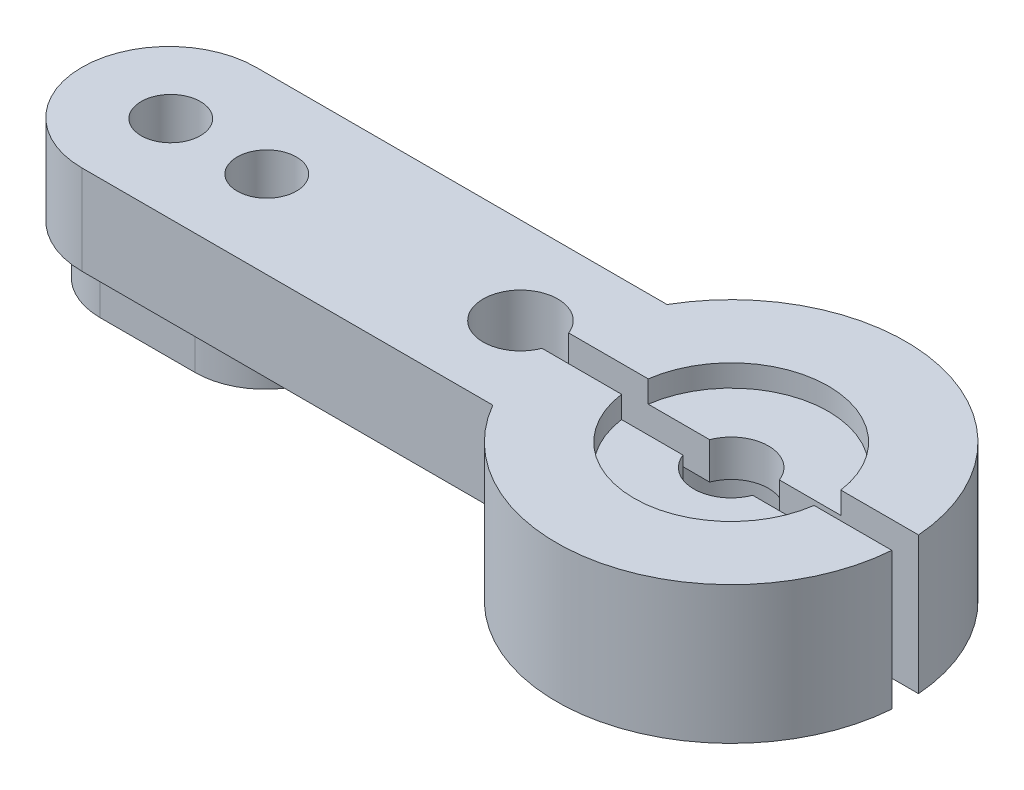
ISO-10303-21;
HEADER;
FILE_DESCRIPTION(('STEP AP214'),'2;1');
FILE_NAME('part.step','',(''),(''),'','','');
FILE_SCHEMA(('AUTOMOTIVE_DESIGN { 1 0 10303 214 1 1 1 1 }'));
ENDSEC;
DATA;
#1=APPLICATION_CONTEXT('core data for automotive mechanical design processes');
#2=APPLICATION_PROTOCOL_DEFINITION('international standard','automotive_design',2000,#1);
#3=PRODUCT_CONTEXT('',#1,'mechanical');
#4=PRODUCT('Part','Part','',(#3));
#5=PRODUCT_RELATED_PRODUCT_CATEGORY('part','',(#4));
#6=PRODUCT_DEFINITION_FORMATION('','',#4);
#7=PRODUCT_DEFINITION_CONTEXT('part definition',#1,'design');
#8=PRODUCT_DEFINITION('design','',#6,#7);
#9=PRODUCT_DEFINITION_SHAPE('','',#8);
#10=(LENGTH_UNIT() NAMED_UNIT(*) SI_UNIT(.MILLI.,.METRE.));
#11=(NAMED_UNIT(*) PLANE_ANGLE_UNIT() SI_UNIT($,.RADIAN.));
#12=(NAMED_UNIT(*) SI_UNIT($,.STERADIAN.) SOLID_ANGLE_UNIT());
#13=UNCERTAINTY_MEASURE_WITH_UNIT(LENGTH_MEASURE(1.E-05),#10,'distance_accuracy_value','');
#14=(GEOMETRIC_REPRESENTATION_CONTEXT(3) GLOBAL_UNCERTAINTY_ASSIGNED_CONTEXT((#13)) GLOBAL_UNIT_ASSIGNED_CONTEXT((#10,
#11,#12)) REPRESENTATION_CONTEXT('',''));
#15=CARTESIAN_POINT('',(0.,0.,0.));
#16=DIRECTION('',(0.,0.,1.));
#17=DIRECTION('',(1.,0.,0.));
#18=AXIS2_PLACEMENT_3D('',#15,#16,#17);
#19=CARTESIAN_POINT('',(-24.0919,2.0574,0.));
#20=DIRECTION('',(0.,1.,0.));
#21=DIRECTION('',(0.,0.,1.));
#22=AXIS2_PLACEMENT_3D('',#19,#20,#21);
#23=PLANE('',#22);
#24=CARTESIAN_POINT('',(-24.0284,2.0574,0.));
#25=DIRECTION('',(0.,-1.,0.));
#26=DIRECTION('',(0.,0.,-1.));
#27=AXIS2_PLACEMENT_3D('',#24,#25,#26);
#28=CIRCLE('',#27,3.0099);
#29=CARTESIAN_POINT('',(-24.0284,2.0574,3.0099));
#30=VERTEX_POINT('',#29);
#31=CARTESIAN_POINT('',(-24.0284,2.0574,-3.0099));
#32=VERTEX_POINT('',#31);
#33=EDGE_CURVE('E339',#30,#32,#28,.T.);
#34=ORIENTED_EDGE('',*,*,#33,.F.);
#35=DIRECTION('',(-1.,0.,0.));
#36=VECTOR('',#35,1.);
#37=CARTESIAN_POINT('',(-24.0284,2.0574,3.0099));
#38=LINE('',#37,#36);
#39=CARTESIAN_POINT('',(-19.9644,2.0574,3.0099));
#40=VERTEX_POINT('',#39);
#41=EDGE_CURVE('E332',#40,#30,#38,.T.);
#42=ORIENTED_EDGE('',*,*,#41,.F.);
#43=CARTESIAN_POINT('',(-19.9644,2.0574,0.));
#44=DIRECTION('',(0.,-1.,0.));
#45=DIRECTION('',(0.,0.,-1.));
#46=AXIS2_PLACEMENT_3D('',#43,#44,#45);
#47=CIRCLE('',#46,3.0099);
#48=CARTESIAN_POINT('',(-19.9644,2.0574,-3.0099));
#49=VERTEX_POINT('',#48);
#50=EDGE_CURVE('E343',#49,#40,#47,.T.);
#51=ORIENTED_EDGE('',*,*,#50,.F.);
#52=DIRECTION('',(1.,0.,0.));
#53=VECTOR('',#52,1.);
#54=CARTESIAN_POINT('',(-24.0284,2.0574,-3.0099));
#55=LINE('',#54,#53);
#56=EDGE_CURVE('E86',#32,#49,#55,.T.);
#57=ORIENTED_EDGE('',*,*,#56,.F.);
#58=EDGE_LOOP('',(#34,#42,#51,#57));
#59=FACE_BOUND('',#58,.T.);
#60=DIRECTION('',(1.,0.,0.));
#61=VECTOR('',#60,1.);
#62=CARTESIAN_POINT('',(-24.0919,2.0574,-0.571500000000003));
#63=LINE('',#62,#61);
#64=CARTESIAN_POINT('',(-7.5350335522599,2.0574,-0.571500000000001));
#65=VERTEX_POINT('',#64);
#66=CARTESIAN_POINT('',(-7.45843655466747,2.0574,-0.571500000000001));
#67=VERTEX_POINT('',#66);
#68=EDGE_CURVE('E293',#65,#67,#63,.T.);
#69=ORIENTED_EDGE('',*,*,#68,.F.);
#70=CARTESIAN_POINT('',(-9.0297,2.0574,0.));
#71=DIRECTION('',(0.,1.,0.));
#72=DIRECTION('',(0.,0.,1.));
#73=AXIS2_PLACEMENT_3D('',#70,#71,#72);
#74=CIRCLE('',#73,1.6002);
#75=CARTESIAN_POINT('',(-7.5350335522599,2.0574,0.5715));
#76=VERTEX_POINT('',#75);
#77=EDGE_CURVE('E244',#65,#76,#74,.T.);
#78=ORIENTED_EDGE('',*,*,#77,.T.);
#79=DIRECTION('',(1.,0.,0.));
#80=VECTOR('',#79,1.);
#81=CARTESIAN_POINT('',(-24.0919,2.0574,0.5715));
#82=LINE('',#81,#80);
#83=CARTESIAN_POINT('',(-7.45843655466747,2.0574,0.5715));
#84=VERTEX_POINT('',#83);
#85=EDGE_CURVE('E282',#76,#84,#82,.T.);
#86=ORIENTED_EDGE('',*,*,#85,.T.);
#87=CARTESIAN_POINT('',(0.,2.0574,0.));
#88=DIRECTION('',(0.,-1.,0.));
#89=DIRECTION('',(0.,0.,1.));
#90=AXIS2_PLACEMENT_3D('',#87,#88,#89);
#91=CIRCLE('',#90,7.4803);
#92=CARTESIAN_POINT('',(-6.48179185488087,2.0574,3.7338));
#93=VERTEX_POINT('',#92);
#94=EDGE_CURVE('E367',#93,#84,#91,.T.);
#95=ORIENTED_EDGE('',*,*,#94,.F.);
#96=DIRECTION('',(1.,0.,0.));
#97=VECTOR('',#96,1.);
#98=CARTESIAN_POINT('',(-24.0919,2.0574,3.7338));
#99=LINE('',#98,#97);
#100=CARTESIAN_POINT('',(-24.0919,2.0574,3.7338));
#101=VERTEX_POINT('',#100);
#102=EDGE_CURVE('E362',#101,#93,#99,.T.);
#103=ORIENTED_EDGE('',*,*,#102,.F.);
#104=CARTESIAN_POINT('',(-24.0919,2.0574,0.));
#105=DIRECTION('',(0.,1.,0.));
#106=DIRECTION('',(0.,0.,1.));
#107=AXIS2_PLACEMENT_3D('',#104,#105,#106);
#108=CIRCLE('',#107,3.7338);
#109=CARTESIAN_POINT('',(-24.0919,2.0574,-3.7338));
#110=VERTEX_POINT('',#109);
#111=EDGE_CURVE('E359',#110,#101,#108,.T.);
#112=ORIENTED_EDGE('',*,*,#111,.F.);
#113=DIRECTION('',(-1.,0.,0.));
#114=VECTOR('',#113,1.);
#115=CARTESIAN_POINT('',(-24.0919,2.0574,-3.7338));
#116=LINE('',#115,#114);
#117=CARTESIAN_POINT('',(-6.48179185488087,2.0574,-3.7338));
#118=VERTEX_POINT('',#117);
#119=EDGE_CURVE('E370',#118,#110,#116,.T.);
#120=ORIENTED_EDGE('',*,*,#119,.F.);
#121=EDGE_CURVE('E366',#67,#118,#91,.T.);
#122=ORIENTED_EDGE('',*,*,#121,.F.);
#123=EDGE_LOOP('',(#69,#78,#86,#95,#103,#112,#120,#122));
#124=FACE_BOUND('',#123,.T.);
#125=ADVANCED_FACE('F63',(#59,#124),#23,.F.);
#126=CARTESIAN_POINT('',(0.,5.8928,0.));
#127=DIRECTION('',(0.,-1.,0.));
#128=DIRECTION('',(0.,0.,-1.));
#129=AXIS2_PLACEMENT_3D('',#126,#127,#128);
#130=CYLINDRICAL_SURFACE('',#129,7.4803);
#131=DIRECTION('',(0.,-1.,0.));
#132=VECTOR('',#131,1.);
#133=CARTESIAN_POINT('',(7.45843655466747,5.8928,-0.5715));
#134=LINE('',#133,#132);
#135=CARTESIAN_POINT('',(7.45843655466747,0.,-0.5715));
#136=VERTEX_POINT('',#135);
#137=CARTESIAN_POINT('',(7.45843655466747,5.8928,-0.5715));
#138=VERTEX_POINT('',#137);
#139=EDGE_CURVE('E306',#136,#138,#134,.F.);
#140=ORIENTED_EDGE('',*,*,#139,.F.);
#141=CARTESIAN_POINT('',(0.,0.,0.));
#142=DIRECTION('',(0.,1.,0.));
#143=DIRECTION('',(0.,0.,1.));
#144=AXIS2_PLACEMENT_3D('',#141,#142,#143);
#145=CIRCLE('',#144,7.4803);
#146=CARTESIAN_POINT('',(-7.45843655466747,0.,-0.571500000000001));
#147=VERTEX_POINT('',#146);
#148=EDGE_CURVE('E405',#136,#147,#145,.T.);
#149=ORIENTED_EDGE('',*,*,#148,.T.);
#150=DIRECTION('',(0.,-1.,0.));
#151=VECTOR('',#150,1.);
#152=CARTESIAN_POINT('',(-7.45843655466747,5.8928,-0.571500000000001));
#153=LINE('',#152,#151);
#154=EDGE_CURVE('E291',#67,#147,#153,.T.);
#155=ORIENTED_EDGE('',*,*,#154,.F.);
#156=ORIENTED_EDGE('',*,*,#121,.T.);
#157=DIRECTION('',(0.,1.,0.));
#158=VECTOR('',#157,1.);
#159=CARTESIAN_POINT('',(-6.48179185488087,2.0574,-3.7338));
#160=LINE('',#159,#158);
#161=CARTESIAN_POINT('',(-6.48179185488087,5.8928,-3.7338));
#162=VERTEX_POINT('',#161);
#163=EDGE_CURVE('E383',#118,#162,#160,.T.);
#164=ORIENTED_EDGE('',*,*,#163,.T.);
#165=CARTESIAN_POINT('',(0.,5.8928,0.));
#166=DIRECTION('',(0.,1.,0.));
#167=DIRECTION('',(0.,0.,1.));
#168=AXIS2_PLACEMENT_3D('',#165,#166,#167);
#169=CIRCLE('',#168,7.4803);
#170=EDGE_CURVE('E401',#138,#162,#169,.T.);
#171=ORIENTED_EDGE('',*,*,#170,.F.);
#172=EDGE_LOOP('',(#140,#149,#155,#156,#164,#171));
#173=FACE_BOUND('',#172,.T.);
#174=ADVANCED_FACE('F65',(#173),#130,.T.);
#175=CARTESIAN_POINT('',(-7.45843655466747,0.,0.5715));
#176=VERTEX_POINT('',#175);
#177=CARTESIAN_POINT('',(7.45843655466747,0.,0.5715));
#178=VERTEX_POINT('',#177);
#179=EDGE_CURVE('E402',#176,#178,#145,.T.);
#180=ORIENTED_EDGE('',*,*,#179,.T.);
#181=DIRECTION('',(0.,-1.,0.));
#182=VECTOR('',#181,1.);
#183=CARTESIAN_POINT('',(7.45843655466747,5.8928,0.5715));
#184=LINE('',#183,#182);
#185=CARTESIAN_POINT('',(7.45843655466747,5.8928,0.5715));
#186=VERTEX_POINT('',#185);
#187=EDGE_CURVE('E316',#178,#186,#184,.F.);
#188=ORIENTED_EDGE('',*,*,#187,.T.);
#189=CARTESIAN_POINT('',(-6.48179185488087,5.8928,3.7338));
#190=VERTEX_POINT('',#189);
#191=EDGE_CURVE('E397',#190,#186,#169,.T.);
#192=ORIENTED_EDGE('',*,*,#191,.F.);
#193=DIRECTION('',(0.,1.,0.));
#194=VECTOR('',#193,1.);
#195=CARTESIAN_POINT('',(-6.48179185488087,2.0574,3.7338));
#196=LINE('',#195,#194);
#197=EDGE_CURVE('E386',#93,#190,#196,.T.);
#198=ORIENTED_EDGE('',*,*,#197,.F.);
#199=ORIENTED_EDGE('',*,*,#94,.T.);
#200=DIRECTION('',(0.,-1.,0.));
#201=VECTOR('',#200,1.);
#202=CARTESIAN_POINT('',(-7.45843655466747,5.8928,0.5715));
#203=LINE('',#202,#201);
#204=EDGE_CURVE('E279',#84,#176,#203,.T.);
#205=ORIENTED_EDGE('',*,*,#204,.T.);
#206=EDGE_LOOP('',(#180,#188,#192,#198,#199,#205));
#207=FACE_BOUND('',#206,.T.);
#208=ADVANCED_FACE('F482',(#207),#130,.T.);
#209=CARTESIAN_POINT('',(0.,5.8928,0.));
#210=DIRECTION('',(0.,1.,0.));
#211=DIRECTION('',(0.,0.,1.));
#212=AXIS2_PLACEMENT_3D('',#209,#210,#211);
#213=PLANE('',#212);
#214=CARTESIAN_POINT('',(-24.0157,5.8928,0.));
#215=DIRECTION('',(0.,1.,0.));
#216=DIRECTION('',(0.,0.,1.));
#217=AXIS2_PLACEMENT_3D('',#214,#215,#216);
#218=CIRCLE('',#217,1.27);
#219=CARTESIAN_POINT('',(-24.0157,5.8928,1.27));
#220=VERTEX_POINT('',#219);
#221=EDGE_CURVE('E464',#220,#220,#218,.T.);
#222=ORIENTED_EDGE('',*,*,#221,.F.);
#223=EDGE_LOOP('',(#222));
#224=FACE_BOUND('',#223,.T.);
#225=CARTESIAN_POINT('',(-19.9009,5.8928,0.));
#226=DIRECTION('',(0.,1.,0.));
#227=DIRECTION('',(0.,0.,1.));
#228=AXIS2_PLACEMENT_3D('',#225,#226,#227);
#229=CIRCLE('',#228,1.27);
#230=CARTESIAN_POINT('',(-19.9009,5.8928,1.27));
#231=VERTEX_POINT('',#230);
#232=EDGE_CURVE('E461',#231,#231,#229,.T.);
#233=ORIENTED_EDGE('',*,*,#232,.F.);
#234=EDGE_LOOP('',(#233));
#235=FACE_BOUND('',#234,.T.);
#236=DIRECTION('',(1.,0.,0.));
#237=VECTOR('',#236,1.);
#238=CARTESIAN_POINT('',(-9.0297,5.8928,0.5715));
#239=LINE('',#238,#237);
#240=CARTESIAN_POINT('',(4.12621026003281,5.8928,0.5715));
#241=VERTEX_POINT('',#240);
#242=EDGE_CURVE('E453',#241,#186,#239,.T.);
#243=ORIENTED_EDGE('',*,*,#242,.F.);
#244=CARTESIAN_POINT('',(0.,5.8928,0.));
#245=DIRECTION('',(0.,1.,0.));
#246=DIRECTION('',(0.,0.,1.));
#247=AXIS2_PLACEMENT_3D('',#244,#245,#246);
#248=CIRCLE('',#247,4.1656);
#249=CARTESIAN_POINT('',(-4.12621026003281,5.8928,0.5715));
#250=VERTEX_POINT('',#249);
#251=EDGE_CURVE('E320',#250,#241,#248,.T.);
#252=ORIENTED_EDGE('',*,*,#251,.F.);
#253=CARTESIAN_POINT('',(-7.5350335522599,5.8928,0.5715));
#254=VERTEX_POINT('',#253);
#255=EDGE_CURVE('E263',#254,#250,#239,.T.);
#256=ORIENTED_EDGE('',*,*,#255,.F.);
#257=CARTESIAN_POINT('',(-9.0297,5.8928,0.));
#258=DIRECTION('',(0.,1.,0.));
#259=DIRECTION('',(0.,0.,1.));
#260=AXIS2_PLACEMENT_3D('',#257,#258,#259);
#261=CIRCLE('',#260,1.6002);
#262=CARTESIAN_POINT('',(-7.5350335522599,5.8928,-0.571500000000001));
#263=VERTEX_POINT('',#262);
#264=EDGE_CURVE('E241',#263,#254,#261,.T.);
#265=ORIENTED_EDGE('',*,*,#264,.F.);
#266=DIRECTION('',(1.,0.,0.));
#267=VECTOR('',#266,1.);
#268=CARTESIAN_POINT('',(-9.0297,5.8928,-0.571500000000001));
#269=LINE('',#268,#267);
#270=CARTESIAN_POINT('',(-4.12621026003281,5.8928,-0.571500000000001));
#271=VERTEX_POINT('',#270);
#272=EDGE_CURVE('E250',#263,#271,#269,.T.);
#273=ORIENTED_EDGE('',*,*,#272,.T.);
#274=CARTESIAN_POINT('',(4.12621026003281,5.8928,-0.5715));
#275=VERTEX_POINT('',#274);
#276=EDGE_CURVE('E325',#275,#271,#248,.T.);
#277=ORIENTED_EDGE('',*,*,#276,.F.);
#278=EDGE_CURVE('E257',#275,#138,#269,.T.);
#279=ORIENTED_EDGE('',*,*,#278,.T.);
#280=ORIENTED_EDGE('',*,*,#170,.T.);
#281=DIRECTION('',(-1.,0.,0.));
#282=VECTOR('',#281,1.);
#283=CARTESIAN_POINT('',(-24.0919,5.8928,-3.7338));
#284=LINE('',#283,#282);
#285=CARTESIAN_POINT('',(-24.0919,5.8928,-3.7338));
#286=VERTEX_POINT('',#285);
#287=EDGE_CURVE('E363',#162,#286,#284,.T.);
#288=ORIENTED_EDGE('',*,*,#287,.T.);
#289=CARTESIAN_POINT('',(-24.0919,5.8928,0.));
#290=DIRECTION('',(0.,1.,0.));
#291=DIRECTION('',(0.,0.,1.));
#292=AXIS2_PLACEMENT_3D('',#289,#290,#291);
#293=CIRCLE('',#292,3.7338);
#294=CARTESIAN_POINT('',(-24.0919,5.8928,3.7338));
#295=VERTEX_POINT('',#294);
#296=EDGE_CURVE('E358',#286,#295,#293,.T.);
#297=ORIENTED_EDGE('',*,*,#296,.T.);
#298=DIRECTION('',(1.,0.,0.));
#299=VECTOR('',#298,1.);
#300=CARTESIAN_POINT('',(-24.0919,5.8928,3.7338));
#301=LINE('',#300,#299);
#302=EDGE_CURVE('E376',#295,#190,#301,.T.);
#303=ORIENTED_EDGE('',*,*,#302,.T.);
#304=ORIENTED_EDGE('',*,*,#191,.T.);
#305=EDGE_LOOP('',(#243,#252,#256,#265,#273,#277,#279,#280,#288,#297,#303,#304));
#306=FACE_BOUND('',#305,.T.);
#307=ADVANCED_FACE('F261',(#224,#235,#306),#213,.T.);
#308=CARTESIAN_POINT('',(0.,0.,0.));
#309=DIRECTION('',(0.,1.,0.));
#310=DIRECTION('',(0.,0.,1.));
#311=AXIS2_PLACEMENT_3D('',#308,#309,#310);
#312=PLANE('',#311);
#313=DIRECTION('',(1.,0.,0.));
#314=VECTOR('',#313,1.);
#315=CARTESIAN_POINT('',(-9.0297,0.,-0.571500000000001));
#316=LINE('',#315,#314);
#317=CARTESIAN_POINT('',(2.72195103556254,0.,-0.5715));
#318=VERTEX_POINT('',#317);
#319=EDGE_CURVE('E445',#318,#136,#316,.T.);
#320=ORIENTED_EDGE('',*,*,#319,.F.);
#321=CARTESIAN_POINT('',(0.,0.,0.));
#322=DIRECTION('',(0.,-1.,0.));
#323=DIRECTION('',(0.,0.,-1.));
#324=AXIS2_PLACEMENT_3D('',#321,#322,#323);
#325=CIRCLE('',#324,2.7813);
#326=CARTESIAN_POINT('',(-2.72195103556254,0.,-0.571500000000001));
#327=VERTEX_POINT('',#326);
#328=EDGE_CURVE('E382',#327,#318,#325,.T.);
#329=ORIENTED_EDGE('',*,*,#328,.F.);
#330=EDGE_CURVE('E446',#147,#327,#316,.T.);
#331=ORIENTED_EDGE('',*,*,#330,.F.);
#332=ORIENTED_EDGE('',*,*,#148,.F.);
#333=EDGE_LOOP('',(#320,#329,#331,#332));
#334=FACE_BOUND('',#333,.T.);
#335=ADVANCED_FACE('F443',(#334),#312,.F.);
#336=CARTESIAN_POINT('',(2.72195103556254,0.,0.5715));
#337=VERTEX_POINT('',#336);
#338=CARTESIAN_POINT('',(-2.72195103556254,0.,0.5715));
#339=VERTEX_POINT('',#338);
#340=EDGE_CURVE('E394',#337,#339,#325,.T.);
#341=ORIENTED_EDGE('',*,*,#340,.F.);
#342=DIRECTION('',(1.,0.,0.));
#343=VECTOR('',#342,1.);
#344=CARTESIAN_POINT('',(-9.0297,0.,0.5715));
#345=LINE('',#344,#343);
#346=EDGE_CURVE('E258',#337,#178,#345,.T.);
#347=ORIENTED_EDGE('',*,*,#346,.T.);
#348=ORIENTED_EDGE('',*,*,#179,.F.);
#349=EDGE_CURVE('E449',#176,#339,#345,.T.);
#350=ORIENTED_EDGE('',*,*,#349,.T.);
#351=EDGE_LOOP('',(#341,#347,#348,#350));
#352=FACE_BOUND('',#351,.T.);
#353=ADVANCED_FACE('F525',(#352),#312,.F.);
#354=CARTESIAN_POINT('',(0.,3.3782,0.));
#355=DIRECTION('',(0.,-1.,0.));
#356=DIRECTION('',(0.,0.,-1.));
#357=AXIS2_PLACEMENT_3D('',#354,#355,#356);
#358=CYLINDRICAL_SURFACE('',#357,2.7813);
#359=DIRECTION('',(0.,-1.,0.));
#360=VECTOR('',#359,1.);
#361=CARTESIAN_POINT('',(2.72195103556254,3.3782,-0.5715));
#362=LINE('',#361,#360);
#363=CARTESIAN_POINT('',(2.72195103556254,3.3782,-0.5715));
#364=VERTEX_POINT('',#363);
#365=EDGE_CURVE('E304',#364,#318,#362,.T.);
#366=ORIENTED_EDGE('',*,*,#365,.F.);
#367=CARTESIAN_POINT('',(0.,3.3782,0.));
#368=DIRECTION('',(0.,-1.,0.));
#369=DIRECTION('',(0.,0.,-1.));
#370=AXIS2_PLACEMENT_3D('',#367,#368,#369);
#371=CIRCLE('',#370,2.7813);
#372=CARTESIAN_POINT('',(-2.72195103556254,3.3782,-0.571500000000001));
#373=VERTEX_POINT('',#372);
#374=EDGE_CURVE('E390',#373,#364,#371,.T.);
#375=ORIENTED_EDGE('',*,*,#374,.F.);
#376=DIRECTION('',(0.,-1.,0.));
#377=VECTOR('',#376,1.);
#378=CARTESIAN_POINT('',(-2.72195103556254,3.3782,-0.571500000000001));
#379=LINE('',#378,#377);
#380=EDGE_CURVE('E289',#327,#373,#379,.F.);
#381=ORIENTED_EDGE('',*,*,#380,.F.);
#382=ORIENTED_EDGE('',*,*,#328,.T.);
#383=EDGE_LOOP('',(#366,#375,#381,#382));
#384=FACE_BOUND('',#383,.T.);
#385=ADVANCED_FACE('F522',(#384),#358,.F.);
#386=CARTESIAN_POINT('',(2.72195103556254,3.3782,0.5715));
#387=VERTEX_POINT('',#386);
#388=CARTESIAN_POINT('',(-2.72195103556254,3.3782,0.5715));
#389=VERTEX_POINT('',#388);
#390=EDGE_CURVE('E393',#387,#389,#371,.T.);
#391=ORIENTED_EDGE('',*,*,#390,.F.);
#392=DIRECTION('',(0.,-1.,0.));
#393=VECTOR('',#392,1.);
#394=CARTESIAN_POINT('',(2.72195103556254,3.3782,0.5715));
#395=LINE('',#394,#393);
#396=EDGE_CURVE('E313',#387,#337,#395,.T.);
#397=ORIENTED_EDGE('',*,*,#396,.T.);
#398=ORIENTED_EDGE('',*,*,#340,.T.);
#399=DIRECTION('',(0.,-1.,0.));
#400=VECTOR('',#399,1.);
#401=CARTESIAN_POINT('',(-2.72195103556254,3.3782,0.5715));
#402=LINE('',#401,#400);
#403=EDGE_CURVE('E276',#339,#389,#402,.F.);
#404=ORIENTED_EDGE('',*,*,#403,.T.);
#405=EDGE_LOOP('',(#391,#397,#398,#404));
#406=FACE_BOUND('',#405,.T.);
#407=ADVANCED_FACE('F524',(#406),#358,.F.);
#408=CARTESIAN_POINT('',(0.,3.3782,0.));
#409=DIRECTION('',(0.,-1.,0.));
#410=DIRECTION('',(0.,0.,-1.));
#411=AXIS2_PLACEMENT_3D('',#408,#409,#410);
#412=PLANE('',#411);
#413=ORIENTED_EDGE('',*,*,#374,.T.);
#414=DIRECTION('',(-1.,0.,0.));
#415=VECTOR('',#414,1.);
#416=CARTESIAN_POINT('',(0.,3.3782,-0.571500000000001));
#417=LINE('',#416,#415);
#418=CARTESIAN_POINT('',(1.4946664477401,3.3782,-0.571500000000001));
#419=VERTEX_POINT('',#418);
#420=EDGE_CURVE('E301',#364,#419,#417,.T.);
#421=ORIENTED_EDGE('',*,*,#420,.T.);
#422=CARTESIAN_POINT('',(0.,3.3782,0.));
#423=DIRECTION('',(0.,-1.,0.));
#424=DIRECTION('',(0.,0.,-1.));
#425=AXIS2_PLACEMENT_3D('',#422,#423,#424);
#426=CIRCLE('',#425,1.6002);
#427=CARTESIAN_POINT('',(-1.4946664477401,3.3782,-0.571500000000001));
#428=VERTEX_POINT('',#427);
#429=EDGE_CURVE('E295',#428,#419,#426,.T.);
#430=ORIENTED_EDGE('',*,*,#429,.F.);
#431=DIRECTION('',(-1.,0.,0.));
#432=VECTOR('',#431,1.);
#433=CARTESIAN_POINT('',(0.,3.3782,-0.571500000000001));
#434=LINE('',#433,#432);
#435=EDGE_CURVE('E286',#428,#373,#434,.T.);
#436=ORIENTED_EDGE('',*,*,#435,.T.);
#437=EDGE_LOOP('',(#413,#421,#430,#436));
#438=FACE_BOUND('',#437,.T.);
#439=ADVANCED_FACE('F521',(#438),#412,.T.);
#440=CARTESIAN_POINT('',(0.,4.953,0.));
#441=DIRECTION('',(0.,1.,0.));
#442=DIRECTION('',(0.,0.,1.));
#443=AXIS2_PLACEMENT_3D('',#440,#441,#442);
#444=CYLINDRICAL_SURFACE('',#443,4.1656);
#445=DIRECTION('',(0.,1.,0.));
#446=VECTOR('',#445,1.);
#447=CARTESIAN_POINT('',(4.12621026003281,4.953,-0.5715));
#448=LINE('',#447,#446);
#449=CARTESIAN_POINT('',(4.12621026003281,4.953,-0.5715));
#450=VERTEX_POINT('',#449);
#451=EDGE_CURVE('E299',#275,#450,#448,.F.);
#452=ORIENTED_EDGE('',*,*,#451,.F.);
#453=ORIENTED_EDGE('',*,*,#276,.T.);
#454=DIRECTION('',(0.,1.,0.));
#455=VECTOR('',#454,1.);
#456=CARTESIAN_POINT('',(-4.12621026003281,4.953,-0.571500000000001));
#457=LINE('',#456,#455);
#458=CARTESIAN_POINT('',(-4.12621026003281,4.953,-0.571500000000001));
#459=VERTEX_POINT('',#458);
#460=EDGE_CURVE('E253',#459,#271,#457,.T.);
#461=ORIENTED_EDGE('',*,*,#460,.F.);
#462=CARTESIAN_POINT('',(0.,4.953,0.));
#463=DIRECTION('',(0.,1.,0.));
#464=DIRECTION('',(0.,0.,1.));
#465=AXIS2_PLACEMENT_3D('',#462,#463,#464);
#466=CIRCLE('',#465,4.1656);
#467=EDGE_CURVE('E324',#450,#459,#466,.T.);
#468=ORIENTED_EDGE('',*,*,#467,.F.);
#469=EDGE_LOOP('',(#452,#453,#461,#468));
#470=FACE_BOUND('',#469,.T.);
#471=ADVANCED_FACE('F428',(#470),#444,.F.);
#472=ORIENTED_EDGE('',*,*,#251,.T.);
#473=DIRECTION('',(0.,1.,0.));
#474=VECTOR('',#473,1.);
#475=CARTESIAN_POINT('',(4.12621026003281,4.953,0.5715));
#476=LINE('',#475,#474);
#477=CARTESIAN_POINT('',(4.12621026003281,4.953,0.5715));
#478=VERTEX_POINT('',#477);
#479=EDGE_CURVE('E308',#241,#478,#476,.F.);
#480=ORIENTED_EDGE('',*,*,#479,.T.);
#481=CARTESIAN_POINT('',(-4.12621026003281,4.953,0.5715));
#482=VERTEX_POINT('',#481);
#483=EDGE_CURVE('E321',#482,#478,#466,.T.);
#484=ORIENTED_EDGE('',*,*,#483,.F.);
#485=DIRECTION('',(0.,1.,0.));
#486=VECTOR('',#485,1.);
#487=CARTESIAN_POINT('',(-4.12621026003281,4.953,0.5715));
#488=LINE('',#487,#486);
#489=EDGE_CURVE('E78',#482,#250,#488,.T.);
#490=ORIENTED_EDGE('',*,*,#489,.T.);
#491=EDGE_LOOP('',(#472,#480,#484,#490));
#492=FACE_BOUND('',#491,.T.);
#493=ADVANCED_FACE('F557',(#492),#444,.F.);
#494=CARTESIAN_POINT('',(0.,4.953,0.));
#495=DIRECTION('',(0.,1.,0.));
#496=DIRECTION('',(0.,0.,1.));
#497=AXIS2_PLACEMENT_3D('',#494,#495,#496);
#498=PLANE('',#497);
#499=CARTESIAN_POINT('',(0.,4.953,0.));
#500=DIRECTION('',(0.,1.,0.));
#501=DIRECTION('',(0.,0.,1.));
#502=AXIS2_PLACEMENT_3D('',#499,#500,#501);
#503=CIRCLE('',#502,1.6002);
#504=CARTESIAN_POINT('',(1.4946664477401,4.953,-0.571500000000001));
#505=VERTEX_POINT('',#504);
#506=CARTESIAN_POINT('',(-1.4946664477401,4.953,-0.571500000000001));
#507=VERTEX_POINT('',#506);
#508=EDGE_CURVE('E71',#505,#507,#503,.T.);
#509=ORIENTED_EDGE('',*,*,#508,.F.);
#510=DIRECTION('',(1.,0.,0.));
#511=VECTOR('',#510,1.);
#512=CARTESIAN_POINT('',(0.,4.953,-0.571500000000001));
#513=LINE('',#512,#511);
#514=EDGE_CURVE('E12',#505,#450,#513,.T.);
#515=ORIENTED_EDGE('',*,*,#514,.T.);
#516=ORIENTED_EDGE('',*,*,#467,.T.);
#517=DIRECTION('',(1.,0.,0.));
#518=VECTOR('',#517,1.);
#519=CARTESIAN_POINT('',(0.,4.953,-0.571500000000001));
#520=LINE('',#519,#518);
#521=EDGE_CURVE('E411',#459,#507,#520,.T.);
#522=ORIENTED_EDGE('',*,*,#521,.T.);
#523=EDGE_LOOP('',(#509,#515,#516,#522));
#524=FACE_BOUND('',#523,.T.);
#525=ADVANCED_FACE('F424',(#524),#498,.T.);
#526=DIRECTION('',(-1.,0.,0.));
#527=VECTOR('',#526,1.);
#528=CARTESIAN_POINT('',(0.,3.3782,0.5715));
#529=LINE('',#528,#527);
#530=CARTESIAN_POINT('',(1.4946664477401,3.3782,0.5715));
#531=VERTEX_POINT('',#530);
#532=EDGE_CURVE('E311',#387,#531,#529,.T.);
#533=ORIENTED_EDGE('',*,*,#532,.F.);
#534=ORIENTED_EDGE('',*,*,#390,.T.);
#535=DIRECTION('',(-1.,0.,0.));
#536=VECTOR('',#535,1.);
#537=CARTESIAN_POINT('',(0.,3.3782,0.5715));
#538=LINE('',#537,#536);
#539=CARTESIAN_POINT('',(-1.4946664477401,3.3782,0.5715));
#540=VERTEX_POINT('',#539);
#541=EDGE_CURVE('E273',#540,#389,#538,.T.);
#542=ORIENTED_EDGE('',*,*,#541,.F.);
#543=CARTESIAN_POINT('',(0.,3.3782,0.));
#544=DIRECTION('',(0.,-1.,0.));
#545=DIRECTION('',(0.,0.,-1.));
#546=AXIS2_PLACEMENT_3D('',#543,#544,#545);
#547=CIRCLE('',#546,1.6002);
#548=EDGE_CURVE('E297',#531,#540,#547,.T.);
#549=ORIENTED_EDGE('',*,*,#548,.F.);
#550=EDGE_LOOP('',(#533,#534,#542,#549));
#551=FACE_BOUND('',#550,.T.);
#552=ADVANCED_FACE('F516',(#551),#412,.T.);
#553=CARTESIAN_POINT('',(-24.0919,2.0574,0.));
#554=DIRECTION('',(0.,1.,0.));
#555=DIRECTION('',(0.,0.,1.));
#556=AXIS2_PLACEMENT_3D('',#553,#554,#555);
#557=CYLINDRICAL_SURFACE('',#556,3.7338);
#558=ORIENTED_EDGE('',*,*,#296,.F.);
#559=DIRECTION('',(0.,1.,0.));
#560=VECTOR('',#559,1.);
#561=CARTESIAN_POINT('',(-24.0919,2.0574,-3.7338));
#562=LINE('',#561,#560);
#563=EDGE_CURVE('E380',#110,#286,#562,.T.);
#564=ORIENTED_EDGE('',*,*,#563,.F.);
#565=ORIENTED_EDGE('',*,*,#111,.T.);
#566=DIRECTION('',(0.,1.,0.));
#567=VECTOR('',#566,1.);
#568=CARTESIAN_POINT('',(-24.0919,2.0574,3.7338));
#569=LINE('',#568,#567);
#570=EDGE_CURVE('E373',#101,#295,#569,.T.);
#571=ORIENTED_EDGE('',*,*,#570,.T.);
#572=EDGE_LOOP('',(#558,#564,#565,#571));
#573=FACE_BOUND('',#572,.T.);
#574=ADVANCED_FACE('F509',(#573),#557,.T.);
#575=CARTESIAN_POINT('',(-24.0919,2.0574,-3.7338));
#576=DIRECTION('',(0.,0.,-1.));
#577=DIRECTION('',(-1.,0.,0.));
#578=AXIS2_PLACEMENT_3D('',#575,#576,#577);
#579=PLANE('',#578);
#580=ORIENTED_EDGE('',*,*,#287,.F.);
#581=ORIENTED_EDGE('',*,*,#163,.F.);
#582=ORIENTED_EDGE('',*,*,#119,.T.);
#583=ORIENTED_EDGE('',*,*,#563,.T.);
#584=EDGE_LOOP('',(#580,#581,#582,#583));
#585=FACE_BOUND('',#584,.T.);
#586=ADVANCED_FACE('F505',(#585),#579,.T.);
#587=CARTESIAN_POINT('',(-24.0919,2.0574,3.7338));
#588=DIRECTION('',(0.,0.,1.));
#589=DIRECTION('',(1.,0.,0.));
#590=AXIS2_PLACEMENT_3D('',#587,#588,#589);
#591=PLANE('',#590);
#592=ORIENTED_EDGE('',*,*,#302,.F.);
#593=ORIENTED_EDGE('',*,*,#570,.F.);
#594=ORIENTED_EDGE('',*,*,#102,.T.);
#595=ORIENTED_EDGE('',*,*,#197,.T.);
#596=EDGE_LOOP('',(#592,#593,#594,#595));
#597=FACE_BOUND('',#596,.T.);
#598=ADVANCED_FACE('F508',(#597),#591,.T.);
#599=CARTESIAN_POINT('',(-24.0284,0.,0.));
#600=DIRECTION('',(0.,1.,0.));
#601=DIRECTION('',(0.,0.,1.));
#602=AXIS2_PLACEMENT_3D('',#599,#600,#601);
#603=CYLINDRICAL_SURFACE('',#602,3.0099);
#604=ORIENTED_EDGE('',*,*,#33,.T.);
#605=DIRECTION('',(0.,1.,0.));
#606=VECTOR('',#605,1.);
#607=CARTESIAN_POINT('',(-24.0284,0.,-3.0099));
#608=LINE('',#607,#606);
#609=CARTESIAN_POINT('',(-24.0284,0.,-3.0099));
#610=VERTEX_POINT('',#609);
#611=EDGE_CURVE('E356',#610,#32,#608,.T.);
#612=ORIENTED_EDGE('',*,*,#611,.F.);
#613=CARTESIAN_POINT('',(-24.0284,0.,0.));
#614=DIRECTION('',(0.,-1.,0.));
#615=DIRECTION('',(0.,0.,-1.));
#616=AXIS2_PLACEMENT_3D('',#613,#614,#615);
#617=CIRCLE('',#616,3.0099);
#618=CARTESIAN_POINT('',(-24.0284,0.,3.0099));
#619=VERTEX_POINT('',#618);
#620=EDGE_CURVE('E328',#619,#610,#617,.T.);
#621=ORIENTED_EDGE('',*,*,#620,.F.);
#622=DIRECTION('',(0.,1.,0.));
#623=VECTOR('',#622,1.);
#624=CARTESIAN_POINT('',(-24.0284,0.,3.0099));
#625=LINE('',#624,#623);
#626=EDGE_CURVE('E338',#619,#30,#625,.T.);
#627=ORIENTED_EDGE('',*,*,#626,.T.);
#628=EDGE_LOOP('',(#604,#612,#621,#627));
#629=FACE_BOUND('',#628,.T.);
#630=ADVANCED_FACE('F503',(#629),#603,.T.);
#631=CARTESIAN_POINT('',(-24.0284,0.,-3.0099));
#632=DIRECTION('',(0.,0.,1.));
#633=DIRECTION('',(1.,0.,0.));
#634=AXIS2_PLACEMENT_3D('',#631,#632,#633);
#635=PLANE('',#634);
#636=ORIENTED_EDGE('',*,*,#56,.T.);
#637=DIRECTION('',(0.,1.,0.));
#638=VECTOR('',#637,1.);
#639=CARTESIAN_POINT('',(-19.9644,0.,-3.0099));
#640=LINE('',#639,#638);
#641=CARTESIAN_POINT('',(-19.9644,0.,-3.0099));
#642=VERTEX_POINT('',#641);
#643=EDGE_CURVE('E353',#642,#49,#640,.T.);
#644=ORIENTED_EDGE('',*,*,#643,.F.);
#645=DIRECTION('',(1.,0.,0.));
#646=VECTOR('',#645,1.);
#647=CARTESIAN_POINT('',(-24.0284,0.,-3.0099));
#648=LINE('',#647,#646);
#649=EDGE_CURVE('E331',#610,#642,#648,.T.);
#650=ORIENTED_EDGE('',*,*,#649,.F.);
#651=ORIENTED_EDGE('',*,*,#611,.T.);
#652=EDGE_LOOP('',(#636,#644,#650,#651));
#653=FACE_BOUND('',#652,.T.);
#654=ADVANCED_FACE('F725',(#653),#635,.F.);
#655=CARTESIAN_POINT('',(-19.9644,0.,0.));
#656=DIRECTION('',(0.,1.,0.));
#657=DIRECTION('',(0.,0.,1.));
#658=AXIS2_PLACEMENT_3D('',#655,#656,#657);
#659=CYLINDRICAL_SURFACE('',#658,3.0099);
#660=ORIENTED_EDGE('',*,*,#50,.T.);
#661=DIRECTION('',(0.,1.,0.));
#662=VECTOR('',#661,1.);
#663=CARTESIAN_POINT('',(-19.9644,0.,3.0099));
#664=LINE('',#663,#662);
#665=CARTESIAN_POINT('',(-19.9644,0.,3.0099));
#666=VERTEX_POINT('',#665);
#667=EDGE_CURVE('E350',#666,#40,#664,.T.);
#668=ORIENTED_EDGE('',*,*,#667,.F.);
#669=CARTESIAN_POINT('',(-19.9644,0.,0.));
#670=DIRECTION('',(0.,-1.,0.));
#671=DIRECTION('',(0.,0.,-1.));
#672=AXIS2_PLACEMENT_3D('',#669,#670,#671);
#673=CIRCLE('',#672,3.0099);
#674=EDGE_CURVE('E334',#642,#666,#673,.T.);
#675=ORIENTED_EDGE('',*,*,#674,.F.);
#676=ORIENTED_EDGE('',*,*,#643,.T.);
#677=EDGE_LOOP('',(#660,#668,#675,#676));
#678=FACE_BOUND('',#677,.T.);
#679=ADVANCED_FACE('F722',(#678),#659,.T.);
#680=CARTESIAN_POINT('',(-24.0284,0.,3.0099));
#681=DIRECTION('',(0.,0.,-1.));
#682=DIRECTION('',(-1.,0.,0.));
#683=AXIS2_PLACEMENT_3D('',#680,#681,#682);
#684=PLANE('',#683);
#685=ORIENTED_EDGE('',*,*,#41,.T.);
#686=ORIENTED_EDGE('',*,*,#626,.F.);
#687=DIRECTION('',(-1.,0.,0.));
#688=VECTOR('',#687,1.);
#689=CARTESIAN_POINT('',(-24.0284,0.,3.0099));
#690=LINE('',#689,#688);
#691=EDGE_CURVE('E336',#666,#619,#690,.T.);
#692=ORIENTED_EDGE('',*,*,#691,.F.);
#693=ORIENTED_EDGE('',*,*,#667,.T.);
#694=EDGE_LOOP('',(#685,#686,#692,#693));
#695=FACE_BOUND('',#694,.T.);
#696=ADVANCED_FACE('F645',(#695),#684,.F.);
#697=CARTESIAN_POINT('',(-24.0284,0.,0.));
#698=DIRECTION('',(0.,-1.,0.));
#699=DIRECTION('',(0.,0.,-1.));
#700=AXIS2_PLACEMENT_3D('',#697,#698,#699);
#701=PLANE('',#700);
#702=CARTESIAN_POINT('',(-24.0157,0.,0.));
#703=DIRECTION('',(0.,1.,0.));
#704=DIRECTION('',(0.,0.,1.));
#705=AXIS2_PLACEMENT_3D('',#702,#703,#704);
#706=CIRCLE('',#705,1.27);
#707=CARTESIAN_POINT('',(-24.0157,0.,1.27));
#708=VERTEX_POINT('',#707);
#709=EDGE_CURVE('E274',#708,#708,#706,.T.);
#710=ORIENTED_EDGE('',*,*,#709,.T.);
#711=EDGE_LOOP('',(#710));
#712=FACE_BOUND('',#711,.T.);
#713=CARTESIAN_POINT('',(-19.9009,0.,0.));
#714=DIRECTION('',(0.,1.,0.));
#715=DIRECTION('',(0.,0.,1.));
#716=AXIS2_PLACEMENT_3D('',#713,#714,#715);
#717=CIRCLE('',#716,1.27);
#718=CARTESIAN_POINT('',(-19.9009,0.,1.27));
#719=VERTEX_POINT('',#718);
#720=EDGE_CURVE('E458',#719,#719,#717,.T.);
#721=ORIENTED_EDGE('',*,*,#720,.T.);
#722=EDGE_LOOP('',(#721));
#723=FACE_BOUND('',#722,.T.);
#724=ORIENTED_EDGE('',*,*,#620,.T.);
#725=ORIENTED_EDGE('',*,*,#649,.T.);
#726=ORIENTED_EDGE('',*,*,#674,.T.);
#727=ORIENTED_EDGE('',*,*,#691,.T.);
#728=EDGE_LOOP('',(#724,#725,#726,#727));
#729=FACE_BOUND('',#728,.T.);
#730=ADVANCED_FACE('F470',(#712,#723,#729),#701,.T.);
#731=DIRECTION('',(1.,0.,0.));
#732=VECTOR('',#731,1.);
#733=CARTESIAN_POINT('',(0.,4.953,0.5715));
#734=LINE('',#733,#732);
#735=CARTESIAN_POINT('',(1.4946664477401,4.953,0.5715));
#736=VERTEX_POINT('',#735);
#737=EDGE_CURVE('E409',#736,#478,#734,.T.);
#738=ORIENTED_EDGE('',*,*,#737,.F.);
#739=CARTESIAN_POINT('',(0.,4.953,0.));
#740=DIRECTION('',(0.,1.,0.));
#741=DIRECTION('',(0.,0.,1.));
#742=AXIS2_PLACEMENT_3D('',#739,#740,#741);
#743=CIRCLE('',#742,1.6002);
#744=CARTESIAN_POINT('',(-1.4946664477401,4.953,0.5715));
#745=VERTEX_POINT('',#744);
#746=EDGE_CURVE('E407',#745,#736,#743,.T.);
#747=ORIENTED_EDGE('',*,*,#746,.F.);
#748=DIRECTION('',(1.,0.,0.));
#749=VECTOR('',#748,1.);
#750=CARTESIAN_POINT('',(0.,4.953,0.5715));
#751=LINE('',#750,#749);
#752=EDGE_CURVE('E400',#482,#745,#751,.T.);
#753=ORIENTED_EDGE('',*,*,#752,.F.);
#754=ORIENTED_EDGE('',*,*,#483,.T.);
#755=EDGE_LOOP('',(#738,#747,#753,#754));
#756=FACE_BOUND('',#755,.T.);
#757=ADVANCED_FACE('F555',(#756),#498,.T.);
#758=CARTESIAN_POINT('',(-9.0297,0.,0.));
#759=DIRECTION('',(0.,1.,0.));
#760=DIRECTION('',(0.,0.,1.));
#761=AXIS2_PLACEMENT_3D('',#758,#759,#760);
#762=CYLINDRICAL_SURFACE('',#761,1.6002);
#763=DIRECTION('',(0.,1.,0.));
#764=VECTOR('',#763,1.);
#765=CARTESIAN_POINT('',(-7.5350335522599,0.,-0.571500000000001));
#766=LINE('',#765,#764);
#767=EDGE_CURVE('E236',#263,#65,#766,.F.);
#768=ORIENTED_EDGE('',*,*,#767,.F.);
#769=ORIENTED_EDGE('',*,*,#264,.T.);
#770=DIRECTION('',(0.,1.,0.));
#771=VECTOR('',#770,1.);
#772=CARTESIAN_POINT('',(-7.5350335522599,0.,0.5715));
#773=LINE('',#772,#771);
#774=EDGE_CURVE('E247',#254,#76,#773,.F.);
#775=ORIENTED_EDGE('',*,*,#774,.T.);
#776=ORIENTED_EDGE('',*,*,#77,.F.);
#777=EDGE_LOOP('',(#768,#769,#775,#776));
#778=FACE_BOUND('',#777,.T.);
#779=ADVANCED_FACE('F238',(#778),#762,.F.);
#780=CARTESIAN_POINT('',(-9.0297,0.,0.5715));
#781=DIRECTION('',(0.,0.,1.));
#782=DIRECTION('',(1.,0.,0.));
#783=AXIS2_PLACEMENT_3D('',#780,#781,#782);
#784=PLANE('',#783);
#785=ORIENTED_EDGE('',*,*,#346,.F.);
#786=ORIENTED_EDGE('',*,*,#396,.F.);
#787=ORIENTED_EDGE('',*,*,#532,.T.);
#788=DIRECTION('',(0.,1.,0.));
#789=VECTOR('',#788,1.);
#790=CARTESIAN_POINT('',(1.4946664477401,0.,0.5715));
#791=LINE('',#790,#789);
#792=EDGE_CURVE('E421',#531,#736,#791,.T.);
#793=ORIENTED_EDGE('',*,*,#792,.T.);
#794=ORIENTED_EDGE('',*,*,#737,.T.);
#795=ORIENTED_EDGE('',*,*,#479,.F.);
#796=ORIENTED_EDGE('',*,*,#242,.T.);
#797=ORIENTED_EDGE('',*,*,#187,.F.);
#798=EDGE_LOOP('',(#785,#786,#787,#793,#794,#795,#796,#797));
#799=FACE_BOUND('',#798,.T.);
#800=ADVANCED_FACE('F544',(#799),#784,.F.);
#801=CARTESIAN_POINT('',(-9.0297,0.,-0.571500000000001));
#802=DIRECTION('',(0.,0.,1.));
#803=DIRECTION('',(1.,0.,0.));
#804=AXIS2_PLACEMENT_3D('',#801,#802,#803);
#805=PLANE('',#804);
#806=ORIENTED_EDGE('',*,*,#139,.T.);
#807=ORIENTED_EDGE('',*,*,#278,.F.);
#808=ORIENTED_EDGE('',*,*,#451,.T.);
#809=ORIENTED_EDGE('',*,*,#514,.F.);
#810=DIRECTION('',(0.,1.,0.));
#811=VECTOR('',#810,1.);
#812=CARTESIAN_POINT('',(1.4946664477401,0.,-0.571500000000001));
#813=LINE('',#812,#811);
#814=EDGE_CURVE('E264',#419,#505,#813,.T.);
#815=ORIENTED_EDGE('',*,*,#814,.F.);
#816=ORIENTED_EDGE('',*,*,#420,.F.);
#817=ORIENTED_EDGE('',*,*,#365,.T.);
#818=ORIENTED_EDGE('',*,*,#319,.T.);
#819=EDGE_LOOP('',(#806,#807,#808,#809,#815,#816,#817,#818));
#820=FACE_BOUND('',#819,.T.);
#821=ADVANCED_FACE('F671',(#820),#805,.T.);
#822=ORIENTED_EDGE('',*,*,#68,.T.);
#823=ORIENTED_EDGE('',*,*,#154,.T.);
#824=ORIENTED_EDGE('',*,*,#330,.T.);
#825=ORIENTED_EDGE('',*,*,#380,.T.);
#826=ORIENTED_EDGE('',*,*,#435,.F.);
#827=DIRECTION('',(0.,1.,0.));
#828=VECTOR('',#827,1.);
#829=CARTESIAN_POINT('',(-1.4946664477401,0.,-0.571500000000001));
#830=LINE('',#829,#828);
#831=EDGE_CURVE('E267',#507,#428,#830,.F.);
#832=ORIENTED_EDGE('',*,*,#831,.F.);
#833=ORIENTED_EDGE('',*,*,#521,.F.);
#834=ORIENTED_EDGE('',*,*,#460,.T.);
#835=ORIENTED_EDGE('',*,*,#272,.F.);
#836=ORIENTED_EDGE('',*,*,#767,.T.);
#837=EDGE_LOOP('',(#822,#823,#824,#825,#826,#832,#833,#834,#835,#836));
#838=FACE_BOUND('',#837,.T.);
#839=ADVANCED_FACE('F251',(#838),#805,.T.);
#840=ORIENTED_EDGE('',*,*,#774,.F.);
#841=ORIENTED_EDGE('',*,*,#255,.T.);
#842=ORIENTED_EDGE('',*,*,#489,.F.);
#843=ORIENTED_EDGE('',*,*,#752,.T.);
#844=DIRECTION('',(0.,1.,0.));
#845=VECTOR('',#844,1.);
#846=CARTESIAN_POINT('',(-1.4946664477401,0.,0.5715));
#847=LINE('',#846,#845);
#848=EDGE_CURVE('E448',#745,#540,#847,.F.);
#849=ORIENTED_EDGE('',*,*,#848,.T.);
#850=ORIENTED_EDGE('',*,*,#541,.T.);
#851=ORIENTED_EDGE('',*,*,#403,.F.);
#852=ORIENTED_EDGE('',*,*,#349,.F.);
#853=ORIENTED_EDGE('',*,*,#204,.F.);
#854=ORIENTED_EDGE('',*,*,#85,.F.);
#855=EDGE_LOOP('',(#840,#841,#842,#843,#849,#850,#851,#852,#853,#854));
#856=FACE_BOUND('',#855,.T.);
#857=ADVANCED_FACE('F551',(#856),#784,.F.);
#858=CARTESIAN_POINT('',(0.,0.,0.));
#859=DIRECTION('',(0.,1.,0.));
#860=DIRECTION('',(0.,0.,1.));
#861=AXIS2_PLACEMENT_3D('',#858,#859,#860);
#862=CYLINDRICAL_SURFACE('',#861,1.6002);
#863=ORIENTED_EDGE('',*,*,#548,.T.);
#864=ORIENTED_EDGE('',*,*,#848,.F.);
#865=ORIENTED_EDGE('',*,*,#746,.T.);
#866=ORIENTED_EDGE('',*,*,#792,.F.);
#867=EDGE_LOOP('',(#863,#864,#865,#866));
#868=FACE_BOUND('',#867,.T.);
#869=ADVANCED_FACE('F492',(#868),#862,.F.);
#870=ORIENTED_EDGE('',*,*,#429,.T.);
#871=ORIENTED_EDGE('',*,*,#814,.T.);
#872=ORIENTED_EDGE('',*,*,#508,.T.);
#873=ORIENTED_EDGE('',*,*,#831,.T.);
#874=EDGE_LOOP('',(#870,#871,#872,#873));
#875=FACE_BOUND('',#874,.T.);
#876=ADVANCED_FACE('F417',(#875),#862,.F.);
#877=CARTESIAN_POINT('',(-19.9009,0.,0.));
#878=DIRECTION('',(0.,1.,0.));
#879=DIRECTION('',(0.,0.,1.));
#880=AXIS2_PLACEMENT_3D('',#877,#878,#879);
#881=CYLINDRICAL_SURFACE('',#880,1.27);
#882=ORIENTED_EDGE('',*,*,#720,.F.);
#883=EDGE_LOOP('',(#882));
#884=FACE_BOUND('',#883,.T.);
#885=ORIENTED_EDGE('',*,*,#232,.T.);
#886=EDGE_LOOP('',(#885));
#887=FACE_BOUND('',#886,.T.);
#888=ADVANCED_FACE('F476',(#884,#887),#881,.F.);
#889=CARTESIAN_POINT('',(-24.0157,0.,0.));
#890=DIRECTION('',(0.,1.,0.));
#891=DIRECTION('',(0.,0.,1.));
#892=AXIS2_PLACEMENT_3D('',#889,#890,#891);
#893=CYLINDRICAL_SURFACE('',#892,1.27);
#894=ORIENTED_EDGE('',*,*,#709,.F.);
#895=EDGE_LOOP('',(#894));
#896=FACE_BOUND('',#895,.T.);
#897=ORIENTED_EDGE('',*,*,#221,.T.);
#898=EDGE_LOOP('',(#897));
#899=FACE_BOUND('',#898,.T.);
#900=ADVANCED_FACE('F473',(#896,#899),#893,.F.);
#901=CLOSED_SHELL('',(#125,#174,#208,#307,#335,#353,#385,#407,#439,#471,#493,#525,#552,#574,
#586,#598,#630,#654,#679,#696,#730,#757,#779,#800,#821,#839,#857,#869,#876,#888,#900));
#902=MANIFOLD_SOLID_BREP('B2',#901);
#903=ADVANCED_BREP_SHAPE_REPRESENTATION('',(#18,#902),#14);
#904=SHAPE_DEFINITION_REPRESENTATION(#9,#903);
ENDSEC;
END-ISO-10303-21;
